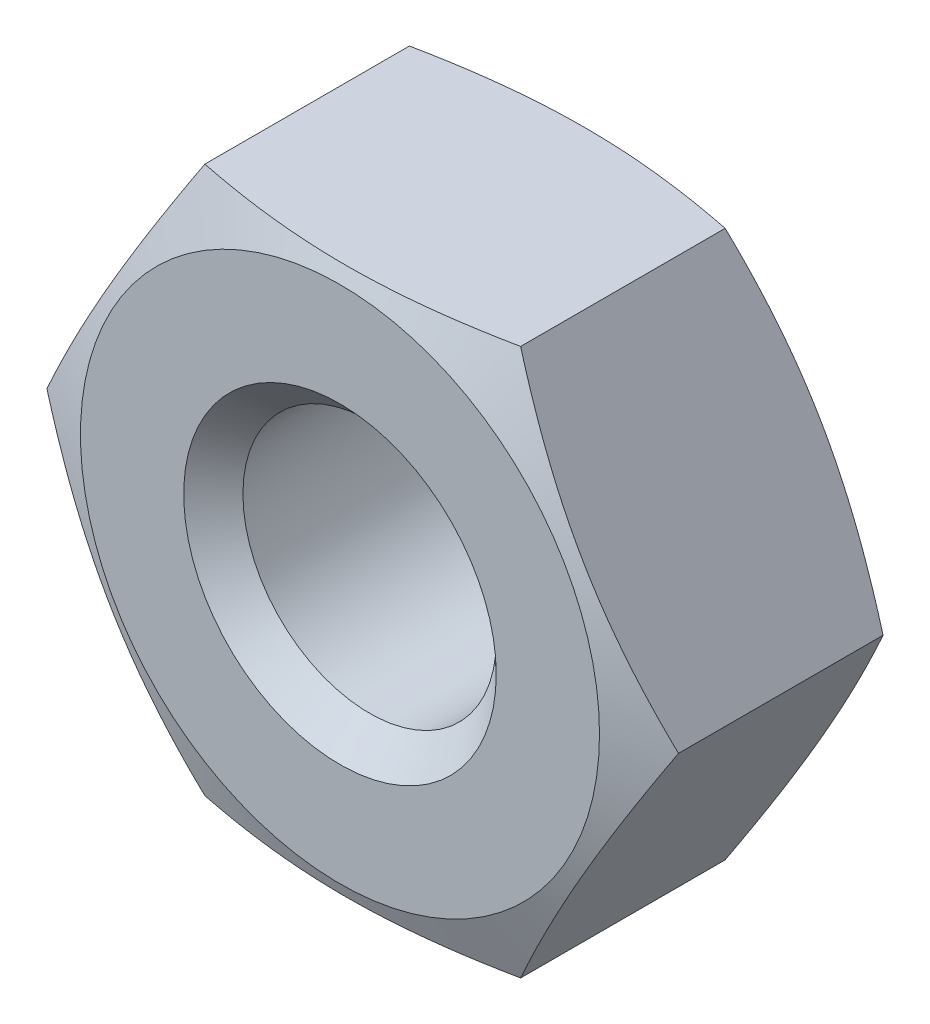
ISO-10303-21;
HEADER;
FILE_DESCRIPTION(('STEP AP214'),'2;1');
FILE_NAME('part.step','',(''),(''),'','','');
FILE_SCHEMA(('AUTOMOTIVE_DESIGN { 1 0 10303 214 1 1 1 1 }'));
ENDSEC;
DATA;
#1=APPLICATION_CONTEXT('core data for automotive mechanical design processes');
#2=APPLICATION_PROTOCOL_DEFINITION('international standard','automotive_design',2000,#1);
#3=PRODUCT_CONTEXT('',#1,'mechanical');
#4=PRODUCT('Part','Part','',(#3));
#5=PRODUCT_RELATED_PRODUCT_CATEGORY('part','',(#4));
#6=PRODUCT_DEFINITION_FORMATION('','',#4);
#7=PRODUCT_DEFINITION_CONTEXT('part definition',#1,'design');
#8=PRODUCT_DEFINITION('design','',#6,#7);
#9=PRODUCT_DEFINITION_SHAPE('','',#8);
#10=(LENGTH_UNIT() NAMED_UNIT(*) SI_UNIT(.MILLI.,.METRE.));
#11=(NAMED_UNIT(*) PLANE_ANGLE_UNIT() SI_UNIT($,.RADIAN.));
#12=(NAMED_UNIT(*) SI_UNIT($,.STERADIAN.) SOLID_ANGLE_UNIT());
#13=UNCERTAINTY_MEASURE_WITH_UNIT(LENGTH_MEASURE(1.E-05),#10,'distance_accuracy_value','');
#14=(GEOMETRIC_REPRESENTATION_CONTEXT(3) GLOBAL_UNCERTAINTY_ASSIGNED_CONTEXT((#13)) GLOBAL_UNIT_ASSIGNED_CONTEXT((#10,
#11,#12)) REPRESENTATION_CONTEXT('',''));
#15=CARTESIAN_POINT('',(0.,0.,0.));
#16=DIRECTION('',(0.,0.,1.));
#17=DIRECTION('',(1.,0.,0.));
#18=AXIS2_PLACEMENT_3D('',#15,#16,#17);
#19=CARTESIAN_POINT('',(-3.0310875,-1.74999918406231,0.));
#20=DIRECTION('',(-0.866025403784439,-0.5,0.));
#21=DIRECTION('',(0.5,-0.866025403784439,0.));
#22=AXIS2_PLACEMENT_3D('',#19,#20,#21);
#23=PLANE('',#22);
#24=CARTESIAN_POINT('',(-4.04145,0.,2.90909090909091));
#25=CARTESIAN_POINT('',(-3.0310875,-1.74999918406231,3.31730385669128));
#26=CARTESIAN_POINT('',(-2.020725,-3.49999836812462,2.90909090909091));
#27=(BOUNDED_CURVE() B_SPLINE_CURVE(2,(#24,#25,#26),.UNSPECIFIED.,.F.,
.F.) B_SPLINE_CURVE_WITH_KNOTS((3,3),(0.,4.06506371496531),
.UNSPECIFIED.) CURVE() GEOMETRIC_REPRESENTATION_ITEM() RATIONAL_B_SPLINE_CURVE((1.,
1.15470053837925,1.)) REPRESENTATION_ITEM(''));
#28=CARTESIAN_POINT('',(-4.04145,0.,2.90909090909091));
#29=VERTEX_POINT('',#28);
#30=CARTESIAN_POINT('',(-2.020725,-3.49999836812462,2.90909090909091));
#31=VERTEX_POINT('',#30);
#32=EDGE_CURVE('E192',#29,#31,#27,.T.);
#33=ORIENTED_EDGE('',*,*,#32,.F.);
#34=DIRECTION('',(0.,0.,1.));
#35=VECTOR('',#34,1.);
#36=CARTESIAN_POINT('',(-4.04145,0.,0.));
#37=LINE('',#36,#35);
#38=CARTESIAN_POINT('',(-4.04145,0.,0.290909090909091));
#39=VERTEX_POINT('',#38);
#40=EDGE_CURVE('E156',#39,#29,#37,.T.);
#41=ORIENTED_EDGE('',*,*,#40,.F.);
#42=CARTESIAN_POINT('',(-2.020725,-3.49999836812462,0.290909090909092));
#43=CARTESIAN_POINT('',(-3.0310875,-1.74999918406231,-0.117303856691283));
#44=CARTESIAN_POINT('',(-4.04145,0.,0.290909090909092));
#45=(BOUNDED_CURVE() B_SPLINE_CURVE(2,(#42,#43,#44),.UNSPECIFIED.,.F.,
.F.) B_SPLINE_CURVE_WITH_KNOTS((3,3),(0.,4.06506371496531),
.UNSPECIFIED.) CURVE() GEOMETRIC_REPRESENTATION_ITEM() RATIONAL_B_SPLINE_CURVE((1.,
1.15470053837925,1.)) REPRESENTATION_ITEM(''));
#46=CARTESIAN_POINT('',(-2.020725,-3.49999836812462,0.290909090909091));
#47=VERTEX_POINT('',#46);
#48=EDGE_CURVE('E100',#47,#39,#45,.T.);
#49=ORIENTED_EDGE('',*,*,#48,.F.);
#50=DIRECTION('',(0.,0.,1.));
#51=VECTOR('',#50,1.);
#52=CARTESIAN_POINT('',(-2.020725,-3.49999836812462,0.));
#53=LINE('',#52,#51);
#54=EDGE_CURVE('E11',#47,#31,#53,.T.);
#55=ORIENTED_EDGE('',*,*,#54,.T.);
#56=EDGE_LOOP('',(#33,#41,#49,#55));
#57=FACE_BOUND('',#56,.T.);
#58=ADVANCED_FACE('F17',(#57),#23,.T.);
#59=CARTESIAN_POINT('',(0.,-3.49999836812462,0.));
#60=DIRECTION('',(0.,-1.,0.));
#61=DIRECTION('',(1.,0.,0.));
#62=AXIS2_PLACEMENT_3D('',#59,#60,#61);
#63=PLANE('',#62);
#64=CARTESIAN_POINT('',(-2.020725,-3.49999836812462,2.90909090909091));
#65=CARTESIAN_POINT('',(0.,-3.49999836812461,3.31730385669129));
#66=CARTESIAN_POINT('',(2.020725,-3.49999836812462,2.90909090909091));
#67=(BOUNDED_CURVE() B_SPLINE_CURVE(2,(#64,#65,#66),.UNSPECIFIED.,.F.,
.F.) B_SPLINE_CURVE_WITH_KNOTS((3,3),(0.,4.06506371496531),
.UNSPECIFIED.) CURVE() GEOMETRIC_REPRESENTATION_ITEM() RATIONAL_B_SPLINE_CURVE((1.,
1.15470053837925,1.)) REPRESENTATION_ITEM(''));
#68=CARTESIAN_POINT('',(2.020725,-3.49999836812462,2.90909090909091));
#69=VERTEX_POINT('',#68);
#70=EDGE_CURVE('E119',#31,#69,#67,.T.);
#71=ORIENTED_EDGE('',*,*,#70,.F.);
#72=ORIENTED_EDGE('',*,*,#54,.F.);
#73=CARTESIAN_POINT('',(2.020725,-3.49999836812462,0.290909090909091));
#74=CARTESIAN_POINT('',(0.,-3.49999836812462,-0.117303856691283));
#75=CARTESIAN_POINT('',(-2.020725,-3.49999836812462,0.290909090909091));
#76=(BOUNDED_CURVE() B_SPLINE_CURVE(2,(#73,#74,#75),.UNSPECIFIED.,.F.,
.F.) B_SPLINE_CURVE_WITH_KNOTS((3,3),(0.,4.06506371496531),
.UNSPECIFIED.) CURVE() GEOMETRIC_REPRESENTATION_ITEM() RATIONAL_B_SPLINE_CURVE((1.,
1.15470053837925,1.)) REPRESENTATION_ITEM(''));
#77=CARTESIAN_POINT('',(2.020725,-3.49999836812462,0.290909090909091));
#78=VERTEX_POINT('',#77);
#79=EDGE_CURVE('E95',#78,#47,#76,.T.);
#80=ORIENTED_EDGE('',*,*,#79,.F.);
#81=DIRECTION('',(0.,0.,1.));
#82=VECTOR('',#81,1.);
#83=CARTESIAN_POINT('',(2.020725,-3.49999836812462,0.));
#84=LINE('',#83,#82);
#85=EDGE_CURVE('E27',#78,#69,#84,.T.);
#86=ORIENTED_EDGE('',*,*,#85,.T.);
#87=EDGE_LOOP('',(#71,#72,#80,#86));
#88=FACE_BOUND('',#87,.T.);
#89=ADVANCED_FACE('F96',(#88),#63,.T.);
#90=CARTESIAN_POINT('',(0.,0.,0.));
#91=DIRECTION('',(0.,0.,1.));
#92=DIRECTION('',(1.,0.,0.));
#93=AXIS2_PLACEMENT_3D('',#90,#91,#92);
#94=PLANE('',#93);
#95=CARTESIAN_POINT('',(0.,0.,0.));
#96=DIRECTION('',(0.,0.,1.));
#97=DIRECTION('',(1.,0.,0.));
#98=AXIS2_PLACEMENT_3D('',#95,#96,#97);
#99=CIRCLE('',#98,3.32142473355163);
#100=CARTESIAN_POINT('',(3.32142473355163,0.,0.));
#101=VERTEX_POINT('',#100);
#102=EDGE_CURVE('E112',#101,#101,#99,.T.);
#103=ORIENTED_EDGE('',*,*,#102,.F.);
#104=EDGE_LOOP('',(#103));
#105=FACE_BOUND('',#104,.T.);
#106=CARTESIAN_POINT('',(0.,0.,0.));
#107=DIRECTION('',(0.,0.,-1.));
#108=DIRECTION('',(1.,0.,0.));
#109=AXIS2_PLACEMENT_3D('',#106,#107,#108);
#110=CIRCLE('',#109,2.);
#111=CARTESIAN_POINT('',(2.,0.,0.));
#112=VERTEX_POINT('',#111);
#113=EDGE_CURVE('E21',#112,#112,#110,.T.);
#114=ORIENTED_EDGE('',*,*,#113,.F.);
#115=EDGE_LOOP('',(#114));
#116=FACE_BOUND('',#115,.T.);
#117=ADVANCED_FACE('F168',(#105,#116),#94,.F.);
#118=CARTESIAN_POINT('',(0.,0.,3.2));
#119=DIRECTION('',(0.,0.,1.));
#120=DIRECTION('',(1.,0.,0.));
#121=AXIS2_PLACEMENT_3D('',#118,#119,#120);
#122=PLANE('',#121);
#123=CARTESIAN_POINT('',(0.,0.,3.2));
#124=DIRECTION('',(0.,0.,-1.));
#125=DIRECTION('',(1.,0.,0.));
#126=AXIS2_PLACEMENT_3D('',#123,#124,#125);
#127=CIRCLE('',#126,3.32142473355163);
#128=CARTESIAN_POINT('',(3.32142473355163,0.,3.2));
#129=VERTEX_POINT('',#128);
#130=EDGE_CURVE('E114',#129,#129,#127,.T.);
#131=ORIENTED_EDGE('',*,*,#130,.F.);
#132=EDGE_LOOP('',(#131));
#133=FACE_BOUND('',#132,.T.);
#134=CARTESIAN_POINT('',(0.,0.,3.2));
#135=DIRECTION('',(0.,0.,1.));
#136=DIRECTION('',(1.,0.,0.));
#137=AXIS2_PLACEMENT_3D('',#134,#135,#136);
#138=CIRCLE('',#137,2.);
#139=CARTESIAN_POINT('',(2.,0.,3.2));
#140=VERTEX_POINT('',#139);
#141=EDGE_CURVE('E154',#140,#140,#138,.T.);
#142=ORIENTED_EDGE('',*,*,#141,.F.);
#143=EDGE_LOOP('',(#142));
#144=FACE_BOUND('',#143,.T.);
#145=ADVANCED_FACE('F171',(#133,#144),#122,.T.);
#146=CARTESIAN_POINT('',(3.0310875,-1.74999918406231,0.));
#147=DIRECTION('',(0.866025403784439,-0.5,0.));
#148=DIRECTION('',(0.5,0.866025403784439,0.));
#149=AXIS2_PLACEMENT_3D('',#146,#147,#148);
#150=PLANE('',#149);
#151=CARTESIAN_POINT('',(2.020725,-3.49999836812462,2.90909090909091));
#152=CARTESIAN_POINT('',(3.0310875,-1.74999918406231,3.31730385669129));
#153=CARTESIAN_POINT('',(4.04145,0.,2.90909090909091));
#154=(BOUNDED_CURVE() B_SPLINE_CURVE(2,(#151,#152,#153),.UNSPECIFIED.,.F.,
.F.) B_SPLINE_CURVE_WITH_KNOTS((3,3),(0.,4.06506371496531),
.UNSPECIFIED.) CURVE() GEOMETRIC_REPRESENTATION_ITEM() RATIONAL_B_SPLINE_CURVE((1.,
1.15470053837925,1.)) REPRESENTATION_ITEM(''));
#155=CARTESIAN_POINT('',(4.04145,0.,2.90909090909091));
#156=VERTEX_POINT('',#155);
#157=EDGE_CURVE('E92',#69,#156,#154,.T.);
#158=ORIENTED_EDGE('',*,*,#157,.F.);
#159=ORIENTED_EDGE('',*,*,#85,.F.);
#160=CARTESIAN_POINT('',(4.04145,0.,0.290909090909091));
#161=CARTESIAN_POINT('',(3.0310875,-1.74999918406231,-0.117303856691283));
#162=CARTESIAN_POINT('',(2.020725,-3.49999836812462,0.290909090909092));
#163=(BOUNDED_CURVE() B_SPLINE_CURVE(2,(#160,#161,#162),.UNSPECIFIED.,.F.,
.F.) B_SPLINE_CURVE_WITH_KNOTS((3,3),(0.,4.06506371496531),
.UNSPECIFIED.) CURVE() GEOMETRIC_REPRESENTATION_ITEM() RATIONAL_B_SPLINE_CURVE((1.,
1.15470053837925,1.)) REPRESENTATION_ITEM(''));
#164=CARTESIAN_POINT('',(4.04145,0.,0.290909090909091));
#165=VERTEX_POINT('',#164);
#166=EDGE_CURVE('E90',#165,#78,#163,.T.);
#167=ORIENTED_EDGE('',*,*,#166,.F.);
#168=DIRECTION('',(0.,0.,1.));
#169=VECTOR('',#168,1.);
#170=CARTESIAN_POINT('',(4.04145,0.,0.));
#171=LINE('',#170,#169);
#172=EDGE_CURVE('E65',#165,#156,#171,.T.);
#173=ORIENTED_EDGE('',*,*,#172,.T.);
#174=EDGE_LOOP('',(#158,#159,#167,#173));
#175=FACE_BOUND('',#174,.T.);
#176=ADVANCED_FACE('F88',(#175),#150,.T.);
#177=CARTESIAN_POINT('',(3.0310875,1.74999918406231,0.));
#178=DIRECTION('',(0.866025403784439,0.5,0.));
#179=DIRECTION('',(-0.5,0.866025403784439,0.));
#180=AXIS2_PLACEMENT_3D('',#177,#178,#179);
#181=PLANE('',#180);
#182=CARTESIAN_POINT('',(4.04145,0.,2.90909090909091));
#183=CARTESIAN_POINT('',(3.0310875,1.74999918406231,3.31730385669128));
#184=CARTESIAN_POINT('',(2.020725,3.49999836812462,2.90909090909091));
#185=(BOUNDED_CURVE() B_SPLINE_CURVE(2,(#182,#183,#184),.UNSPECIFIED.,.F.,
.F.) B_SPLINE_CURVE_WITH_KNOTS((3,3),(0.,4.06506371496531),
.UNSPECIFIED.) CURVE() GEOMETRIC_REPRESENTATION_ITEM() RATIONAL_B_SPLINE_CURVE((1.,
1.15470053837925,1.)) REPRESENTATION_ITEM(''));
#186=CARTESIAN_POINT('',(2.020725,3.49999836812462,2.90909090909091));
#187=VERTEX_POINT('',#186);
#188=EDGE_CURVE('E148',#156,#187,#185,.T.);
#189=ORIENTED_EDGE('',*,*,#188,.F.);
#190=ORIENTED_EDGE('',*,*,#172,.F.);
#191=CARTESIAN_POINT('',(2.020725,3.49999836812462,0.290909090909092));
#192=CARTESIAN_POINT('',(3.0310875,1.74999918406231,-0.117303856691283));
#193=CARTESIAN_POINT('',(4.04145,0.,0.290909090909092));
#194=(BOUNDED_CURVE() B_SPLINE_CURVE(2,(#191,#192,#193),.UNSPECIFIED.,.F.,
.F.) B_SPLINE_CURVE_WITH_KNOTS((3,3),(0.,4.06506371496532),
.UNSPECIFIED.) CURVE() GEOMETRIC_REPRESENTATION_ITEM() RATIONAL_B_SPLINE_CURVE((1.,
1.15470053837925,1.)) REPRESENTATION_ITEM(''));
#195=CARTESIAN_POINT('',(2.020725,3.49999836812462,0.290909090909091));
#196=VERTEX_POINT('',#195);
#197=EDGE_CURVE('E106',#196,#165,#194,.T.);
#198=ORIENTED_EDGE('',*,*,#197,.F.);
#199=DIRECTION('',(0.,0.,1.));
#200=VECTOR('',#199,1.);
#201=CARTESIAN_POINT('',(2.020725,3.49999836812462,0.));
#202=LINE('',#201,#200);
#203=EDGE_CURVE('E155',#196,#187,#202,.T.);
#204=ORIENTED_EDGE('',*,*,#203,.T.);
#205=EDGE_LOOP('',(#189,#190,#198,#204));
#206=FACE_BOUND('',#205,.T.);
#207=ADVANCED_FACE('F227',(#206),#181,.T.);
#208=CARTESIAN_POINT('',(0.,3.49999836812462,0.));
#209=DIRECTION('',(0.,1.,0.));
#210=DIRECTION('',(-1.,0.,0.));
#211=AXIS2_PLACEMENT_3D('',#208,#209,#210);
#212=PLANE('',#211);
#213=CARTESIAN_POINT('',(2.020725,3.49999836812462,2.90909090909091));
#214=CARTESIAN_POINT('',(0.,3.49999836812462,3.31730385669128));
#215=CARTESIAN_POINT('',(-2.020725,3.49999836812462,2.90909090909091));
#216=(BOUNDED_CURVE() B_SPLINE_CURVE(2,(#213,#214,#215),.UNSPECIFIED.,.F.,
.F.) B_SPLINE_CURVE_WITH_KNOTS((3,3),(0.,4.06506371496532),
.UNSPECIFIED.) CURVE() GEOMETRIC_REPRESENTATION_ITEM() RATIONAL_B_SPLINE_CURVE((1.,
1.15470053837925,1.)) REPRESENTATION_ITEM(''));
#217=CARTESIAN_POINT('',(-2.020725,3.49999836812462,2.90909090909091));
#218=VERTEX_POINT('',#217);
#219=EDGE_CURVE('E139',#187,#218,#216,.T.);
#220=ORIENTED_EDGE('',*,*,#219,.F.);
#221=ORIENTED_EDGE('',*,*,#203,.F.);
#222=CARTESIAN_POINT('',(-2.020725,3.49999836812462,0.290909090909091));
#223=CARTESIAN_POINT('',(0.,3.49999836812462,-0.117303856691283));
#224=CARTESIAN_POINT('',(2.020725,3.49999836812462,0.290909090909091));
#225=(BOUNDED_CURVE() B_SPLINE_CURVE(2,(#222,#223,#224),.UNSPECIFIED.,.F.,
.F.) B_SPLINE_CURVE_WITH_KNOTS((3,3),(0.,4.06506371496531),
.UNSPECIFIED.) CURVE() GEOMETRIC_REPRESENTATION_ITEM() RATIONAL_B_SPLINE_CURVE((1.,
1.15470053837925,1.)) REPRESENTATION_ITEM(''));
#226=CARTESIAN_POINT('',(-2.020725,3.49999836812462,0.290909090909091));
#227=VERTEX_POINT('',#226);
#228=EDGE_CURVE('E121',#227,#196,#225,.T.);
#229=ORIENTED_EDGE('',*,*,#228,.F.);
#230=DIRECTION('',(0.,0.,1.));
#231=VECTOR('',#230,1.);
#232=CARTESIAN_POINT('',(-2.020725,3.49999836812462,0.));
#233=LINE('',#232,#231);
#234=EDGE_CURVE('E173',#227,#218,#233,.T.);
#235=ORIENTED_EDGE('',*,*,#234,.T.);
#236=EDGE_LOOP('',(#220,#221,#229,#235));
#237=FACE_BOUND('',#236,.T.);
#238=ADVANCED_FACE('F225',(#237),#212,.T.);
#239=CARTESIAN_POINT('',(-3.0310875,1.74999918406231,0.));
#240=DIRECTION('',(-0.866025403784439,0.5,0.));
#241=DIRECTION('',(-0.5,-0.866025403784439,0.));
#242=AXIS2_PLACEMENT_3D('',#239,#240,#241);
#243=PLANE('',#242);
#244=CARTESIAN_POINT('',(-2.020725,3.49999836812462,2.90909090909091));
#245=CARTESIAN_POINT('',(-3.0310875,1.74999918406231,3.31730385669128));
#246=CARTESIAN_POINT('',(-4.04145,0.,2.90909090909091));
#247=(BOUNDED_CURVE() B_SPLINE_CURVE(2,(#244,#245,#246),.UNSPECIFIED.,.F.,
.F.) B_SPLINE_CURVE_WITH_KNOTS((3,3),(0.,4.06506371496531),
.UNSPECIFIED.) CURVE() GEOMETRIC_REPRESENTATION_ITEM() RATIONAL_B_SPLINE_CURVE((1.,
1.15470053837925,1.)) REPRESENTATION_ITEM(''));
#248=EDGE_CURVE('E147',#218,#29,#247,.T.);
#249=ORIENTED_EDGE('',*,*,#248,.F.);
#250=ORIENTED_EDGE('',*,*,#234,.F.);
#251=CARTESIAN_POINT('',(-4.04145,0.,0.290909090909092));
#252=CARTESIAN_POINT('',(-3.0310875,1.74999918406231,-0.117303856691283));
#253=CARTESIAN_POINT('',(-2.020725,3.49999836812463,0.290909090909092));
#254=(BOUNDED_CURVE() B_SPLINE_CURVE(2,(#251,#252,#253),.UNSPECIFIED.,.F.,
.F.) B_SPLINE_CURVE_WITH_KNOTS((3,3),(0.,4.06506371496532),
.UNSPECIFIED.) CURVE() GEOMETRIC_REPRESENTATION_ITEM() RATIONAL_B_SPLINE_CURVE((1.,
1.15470053837925,1.)) REPRESENTATION_ITEM(''));
#255=EDGE_CURVE('E125',#39,#227,#254,.T.);
#256=ORIENTED_EDGE('',*,*,#255,.F.);
#257=ORIENTED_EDGE('',*,*,#40,.T.);
#258=EDGE_LOOP('',(#249,#250,#256,#257));
#259=FACE_BOUND('',#258,.T.);
#260=ADVANCED_FACE('F224',(#259),#243,.T.);
#261=CARTESIAN_POINT('',(0.,0.,0.1894375));
#262=DIRECTION('',(0.,0.,-1.));
#263=DIRECTION('',(1.,0.,0.));
#264=AXIS2_PLACEMENT_3D('',#261,#262,#263);
#265=CONICAL_SURFACE('',#264,1.8105625,0.785398163397448);
#266=CARTESIAN_POINT('',(0.,0.,0.378875));
#267=DIRECTION('',(0.,0.,1.));
#268=DIRECTION('',(1.,0.,0.));
#269=AXIS2_PLACEMENT_3D('',#266,#267,#268);
#270=CIRCLE('',#269,1.621125);
#271=CARTESIAN_POINT('',(1.621125,0.,0.378875));
#272=VERTEX_POINT('',#271);
#273=EDGE_CURVE('E149',#272,#272,#270,.T.);
#274=ORIENTED_EDGE('',*,*,#273,.T.);
#275=EDGE_LOOP('',(#274));
#276=FACE_BOUND('',#275,.T.);
#277=ORIENTED_EDGE('',*,*,#113,.T.);
#278=EDGE_LOOP('',(#277));
#279=FACE_BOUND('',#278,.T.);
#280=ADVANCED_FACE('F248',(#276,#279),#265,.F.);
#281=CARTESIAN_POINT('',(0.,0.,1.6));
#282=DIRECTION('',(0.,0.,-1.));
#283=DIRECTION('',(1.,0.,0.));
#284=AXIS2_PLACEMENT_3D('',#281,#282,#283);
#285=CYLINDRICAL_SURFACE('',#284,1.621125);
#286=CARTESIAN_POINT('',(0.,0.,2.821125));
#287=DIRECTION('',(0.,0.,1.));
#288=DIRECTION('',(1.,0.,0.));
#289=AXIS2_PLACEMENT_3D('',#286,#287,#288);
#290=CIRCLE('',#289,1.621125);
#291=CARTESIAN_POINT('',(1.621125,0.,2.821125));
#292=VERTEX_POINT('',#291);
#293=EDGE_CURVE('E118',#292,#292,#290,.T.);
#294=ORIENTED_EDGE('',*,*,#293,.T.);
#295=EDGE_LOOP('',(#294));
#296=FACE_BOUND('',#295,.T.);
#297=ORIENTED_EDGE('',*,*,#273,.F.);
#298=EDGE_LOOP('',(#297));
#299=FACE_BOUND('',#298,.T.);
#300=ADVANCED_FACE('F237',(#296,#299),#285,.F.);
#301=CARTESIAN_POINT('',(0.,0.,3.0105625));
#302=DIRECTION('',(0.,0.,1.));
#303=DIRECTION('',(1.,0.,0.));
#304=AXIS2_PLACEMENT_3D('',#301,#302,#303);
#305=CONICAL_SURFACE('',#304,1.8105625,0.785398163397448);
#306=ORIENTED_EDGE('',*,*,#141,.T.);
#307=EDGE_LOOP('',(#306));
#308=FACE_BOUND('',#307,.T.);
#309=ORIENTED_EDGE('',*,*,#293,.F.);
#310=EDGE_LOOP('',(#309));
#311=FACE_BOUND('',#310,.T.);
#312=ADVANCED_FACE('F229',(#308,#311),#305,.F.);
#313=CARTESIAN_POINT('',(0.,0.,3.05454545454546));
#314=DIRECTION('',(0.,0.,-1.));
#315=DIRECTION('',(1.,0.,0.));
#316=AXIS2_PLACEMENT_3D('',#313,#314,#315);
#317=CONICAL_SURFACE('',#316,3.68143736677581,1.18682389135614);
#318=ORIENTED_EDGE('',*,*,#130,.T.);
#319=EDGE_LOOP('',(#318));
#320=FACE_BOUND('',#319,.T.);
#321=ORIENTED_EDGE('',*,*,#157,.T.);
#322=ORIENTED_EDGE('',*,*,#188,.T.);
#323=ORIENTED_EDGE('',*,*,#219,.T.);
#324=ORIENTED_EDGE('',*,*,#248,.T.);
#325=ORIENTED_EDGE('',*,*,#32,.T.);
#326=ORIENTED_EDGE('',*,*,#70,.T.);
#327=EDGE_LOOP('',(#321,#322,#323,#324,#325,#326));
#328=FACE_BOUND('',#327,.T.);
#329=ADVANCED_FACE('F19',(#320,#328),#317,.T.);
#330=CARTESIAN_POINT('',(0.,0.,0.145454545454545));
#331=DIRECTION('',(0.,0.,1.));
#332=DIRECTION('',(1.,0.,0.));
#333=AXIS2_PLACEMENT_3D('',#330,#331,#332);
#334=CONICAL_SURFACE('',#333,3.68143736677581,1.18682389135614);
#335=ORIENTED_EDGE('',*,*,#102,.T.);
#336=EDGE_LOOP('',(#335));
#337=FACE_BOUND('',#336,.T.);
#338=ORIENTED_EDGE('',*,*,#166,.T.);
#339=ORIENTED_EDGE('',*,*,#79,.T.);
#340=ORIENTED_EDGE('',*,*,#48,.T.);
#341=ORIENTED_EDGE('',*,*,#255,.T.);
#342=ORIENTED_EDGE('',*,*,#228,.T.);
#343=ORIENTED_EDGE('',*,*,#197,.T.);
#344=EDGE_LOOP('',(#338,#339,#340,#341,#342,#343));
#345=FACE_BOUND('',#344,.T.);
#346=ADVANCED_FACE('F103',(#337,#345),#334,.T.);
#347=CLOSED_SHELL('',(#58,#89,#117,#145,#176,#207,#238,#260,#280,#300,#312,#329,#346));
#348=MANIFOLD_SOLID_BREP('B1',#347);
#349=ADVANCED_BREP_SHAPE_REPRESENTATION('',(#18,#348),#14);
#350=SHAPE_DEFINITION_REPRESENTATION(#9,#349);
ENDSEC;
END-ISO-10303-21;
